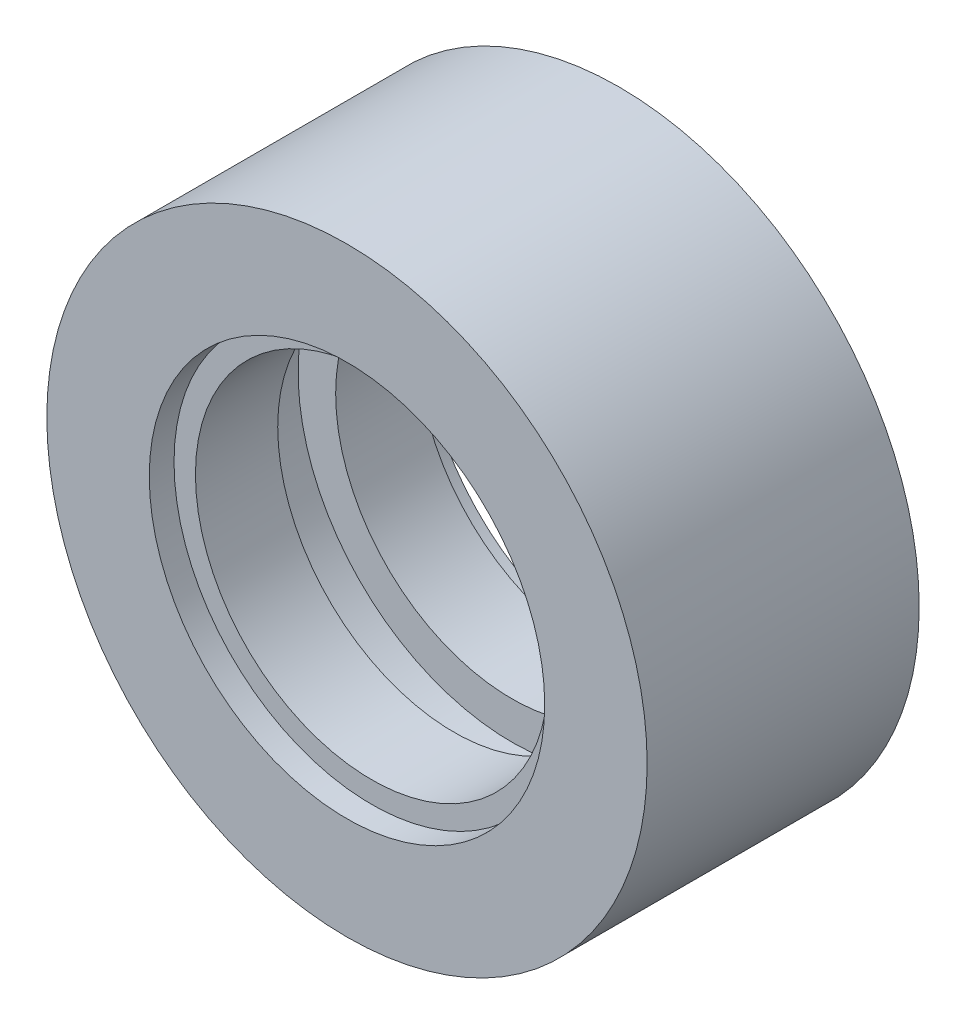
ISO-10303-21;
HEADER;
FILE_DESCRIPTION(('STEP AP214'),'2;1');
FILE_NAME('part.step','',(''),(''),'','','');
FILE_SCHEMA(('AUTOMOTIVE_DESIGN { 1 0 10303 214 1 1 1 1 }'));
ENDSEC;
DATA;
#1=APPLICATION_CONTEXT('core data for automotive mechanical design processes');
#2=APPLICATION_PROTOCOL_DEFINITION('international standard','automotive_design',2000,#1);
#3=PRODUCT_CONTEXT('',#1,'mechanical');
#4=PRODUCT('Part','Part','',(#3));
#5=PRODUCT_RELATED_PRODUCT_CATEGORY('part','',(#4));
#6=PRODUCT_DEFINITION_FORMATION('','',#4);
#7=PRODUCT_DEFINITION_CONTEXT('part definition',#1,'design');
#8=PRODUCT_DEFINITION('design','',#6,#7);
#9=PRODUCT_DEFINITION_SHAPE('','',#8);
#10=(LENGTH_UNIT() NAMED_UNIT(*) SI_UNIT(.MILLI.,.METRE.));
#11=(NAMED_UNIT(*) PLANE_ANGLE_UNIT() SI_UNIT($,.RADIAN.));
#12=(NAMED_UNIT(*) SI_UNIT($,.STERADIAN.) SOLID_ANGLE_UNIT());
#13=UNCERTAINTY_MEASURE_WITH_UNIT(LENGTH_MEASURE(1.E-05),#10,'distance_accuracy_value','');
#14=(GEOMETRIC_REPRESENTATION_CONTEXT(3) GLOBAL_UNCERTAINTY_ASSIGNED_CONTEXT((#13)) GLOBAL_UNIT_ASSIGNED_CONTEXT((#10,
#11,#12)) REPRESENTATION_CONTEXT('',''));
#15=CARTESIAN_POINT('',(0.,0.,0.));
#16=DIRECTION('',(0.,0.,1.));
#17=DIRECTION('',(1.,0.,0.));
#18=AXIS2_PLACEMENT_3D('',#15,#16,#17);
#19=CARTESIAN_POINT('',(0.,0.,-0.000999999999999265));
#20=DIRECTION('',(0.,0.,1.));
#21=DIRECTION('',(1.,0.,0.));
#22=AXIS2_PLACEMENT_3D('',#19,#20,#21);
#23=CYLINDRICAL_SURFACE('',#22,8.4);
#24=CARTESIAN_POINT('',(0.,0.,1.18));
#25=DIRECTION('',(0.,0.,-1.));
#26=DIRECTION('',(-1.,0.,0.));
#27=AXIS2_PLACEMENT_3D('',#24,#25,#26);
#28=CIRCLE('',#27,8.4);
#29=CARTESIAN_POINT('',(-8.4,0.,1.18));
#30=VERTEX_POINT('',#29);
#31=EDGE_CURVE('E54',#30,#30,#28,.F.);
#32=ORIENTED_EDGE('',*,*,#31,.F.);
#33=EDGE_LOOP('',(#32));
#34=FACE_BOUND('',#33,.T.);
#35=CARTESIAN_POINT('',(0.,0.,5.1));
#36=DIRECTION('',(0.,0.,1.));
#37=DIRECTION('',(1.,0.,0.));
#38=AXIS2_PLACEMENT_3D('',#35,#36,#37);
#39=CIRCLE('',#38,8.4);
#40=CARTESIAN_POINT('',(8.4,0.,5.1));
#41=VERTEX_POINT('',#40);
#42=EDGE_CURVE('E36',#41,#41,#39,.F.);
#43=ORIENTED_EDGE('',*,*,#42,.F.);
#44=EDGE_LOOP('',(#43));
#45=FACE_BOUND('',#44,.T.);
#46=ADVANCED_FACE('F32',(#34,#45),#23,.F.);
#47=CARTESIAN_POINT('',(0.,0.,7.86));
#48=DIRECTION('',(0.,0.,1.));
#49=DIRECTION('',(1.,0.,0.));
#50=AXIS2_PLACEMENT_3D('',#47,#48,#49);
#51=CIRCLE('',#50,8.4);
#52=CARTESIAN_POINT('',(8.4,0.,7.86));
#53=VERTEX_POINT('',#52);
#54=EDGE_CURVE('E57',#53,#53,#51,.F.);
#55=ORIENTED_EDGE('',*,*,#54,.T.);
#56=EDGE_LOOP('',(#55));
#57=FACE_BOUND('',#56,.T.);
#58=CARTESIAN_POINT('',(0.,0.,11.78));
#59=DIRECTION('',(0.,0.,1.));
#60=DIRECTION('',(1.,0.,0.));
#61=AXIS2_PLACEMENT_3D('',#58,#59,#60);
#62=CIRCLE('',#61,8.4);
#63=CARTESIAN_POINT('',(8.4,0.,11.78));
#64=VERTEX_POINT('',#63);
#65=EDGE_CURVE('E45',#64,#64,#62,.F.);
#66=ORIENTED_EDGE('',*,*,#65,.F.);
#67=EDGE_LOOP('',(#66));
#68=FACE_BOUND('',#67,.T.);
#69=ADVANCED_FACE('F93',(#57,#68),#23,.F.);
#70=CARTESIAN_POINT('',(0.,0.,12.96));
#71=DIRECTION('',(0.,0.,-1.));
#72=DIRECTION('',(-1.,0.,0.));
#73=AXIS2_PLACEMENT_3D('',#70,#71,#72);
#74=CYLINDRICAL_SURFACE('',#73,14.3);
#75=CARTESIAN_POINT('',(0.,0.,12.96));
#76=DIRECTION('',(0.,0.,1.));
#77=DIRECTION('',(1.,0.,0.));
#78=AXIS2_PLACEMENT_3D('',#75,#76,#77);
#79=CIRCLE('',#78,14.3);
#80=CARTESIAN_POINT('',(14.3,0.,12.96));
#81=VERTEX_POINT('',#80);
#82=EDGE_CURVE('E10',#81,#81,#79,.T.);
#83=ORIENTED_EDGE('',*,*,#82,.F.);
#84=EDGE_LOOP('',(#83));
#85=FACE_BOUND('',#84,.T.);
#86=CARTESIAN_POINT('',(0.,0.,0.));
#87=DIRECTION('',(0.,0.,1.));
#88=DIRECTION('',(1.,0.,0.));
#89=AXIS2_PLACEMENT_3D('',#86,#87,#88);
#90=CIRCLE('',#89,14.3);
#91=CARTESIAN_POINT('',(14.3,0.,0.));
#92=VERTEX_POINT('',#91);
#93=EDGE_CURVE('E40',#92,#92,#90,.T.);
#94=ORIENTED_EDGE('',*,*,#93,.T.);
#95=EDGE_LOOP('',(#94));
#96=FACE_BOUND('',#95,.T.);
#97=ADVANCED_FACE('F34',(#85,#96),#74,.T.);
#98=CARTESIAN_POINT('',(0.,0.,12.96));
#99=DIRECTION('',(0.,0.,1.));
#100=DIRECTION('',(1.,0.,0.));
#101=AXIS2_PLACEMENT_3D('',#98,#99,#100);
#102=PLANE('',#101);
#103=CARTESIAN_POINT('',(0.,0.,12.96));
#104=DIRECTION('',(0.,0.,1.));
#105=DIRECTION('',(1.,0.,0.));
#106=AXIS2_PLACEMENT_3D('',#103,#104,#105);
#107=CIRCLE('',#106,9.42);
#108=CARTESIAN_POINT('',(9.42,0.,12.96));
#109=VERTEX_POINT('',#108);
#110=EDGE_CURVE('E48',#109,#109,#107,.T.);
#111=ORIENTED_EDGE('',*,*,#110,.F.);
#112=EDGE_LOOP('',(#111));
#113=FACE_BOUND('',#112,.T.);
#114=ORIENTED_EDGE('',*,*,#82,.T.);
#115=EDGE_LOOP('',(#114));
#116=FACE_BOUND('',#115,.T.);
#117=ADVANCED_FACE('F83',(#113,#116),#102,.T.);
#118=CARTESIAN_POINT('',(0.,0.,0.));
#119=DIRECTION('',(0.,0.,1.));
#120=DIRECTION('',(1.,0.,0.));
#121=AXIS2_PLACEMENT_3D('',#118,#119,#120);
#122=PLANE('',#121);
#123=CARTESIAN_POINT('',(0.,0.,0.));
#124=DIRECTION('',(0.,0.,1.));
#125=DIRECTION('',(1.,0.,0.));
#126=AXIS2_PLACEMENT_3D('',#123,#124,#125);
#127=CIRCLE('',#126,9.42);
#128=CARTESIAN_POINT('',(9.42,0.,0.));
#129=VERTEX_POINT('',#128);
#130=EDGE_CURVE('E63',#129,#129,#127,.T.);
#131=ORIENTED_EDGE('',*,*,#130,.T.);
#132=EDGE_LOOP('',(#131));
#133=FACE_BOUND('',#132,.T.);
#134=ORIENTED_EDGE('',*,*,#93,.F.);
#135=EDGE_LOOP('',(#134));
#136=FACE_BOUND('',#135,.T.);
#137=ADVANCED_FACE('F85',(#133,#136),#122,.F.);
#138=CARTESIAN_POINT('',(0.,0.,11.78));
#139=DIRECTION('',(0.,0.,1.));
#140=DIRECTION('',(1.,0.,0.));
#141=AXIS2_PLACEMENT_3D('',#138,#139,#140);
#142=PLANE('',#141);
#143=CARTESIAN_POINT('',(0.,0.,11.78));
#144=DIRECTION('',(0.,0.,1.));
#145=DIRECTION('',(1.,0.,0.));
#146=AXIS2_PLACEMENT_3D('',#143,#144,#145);
#147=CIRCLE('',#146,9.42);
#148=CARTESIAN_POINT('',(9.42,0.,11.78));
#149=VERTEX_POINT('',#148);
#150=EDGE_CURVE('E53',#149,#149,#147,.T.);
#151=ORIENTED_EDGE('',*,*,#150,.T.);
#152=EDGE_LOOP('',(#151));
#153=FACE_BOUND('',#152,.T.);
#154=ORIENTED_EDGE('',*,*,#65,.T.);
#155=EDGE_LOOP('',(#154));
#156=FACE_BOUND('',#155,.T.);
#157=ADVANCED_FACE('F91',(#153,#156),#142,.T.);
#158=CARTESIAN_POINT('',(0.,0.,11.78));
#159=DIRECTION('',(0.,0.,1.));
#160=DIRECTION('',(1.,0.,0.));
#161=AXIS2_PLACEMENT_3D('',#158,#159,#160);
#162=CYLINDRICAL_SURFACE('',#161,9.42);
#163=ORIENTED_EDGE('',*,*,#150,.F.);
#164=EDGE_LOOP('',(#163));
#165=FACE_BOUND('',#164,.T.);
#166=ORIENTED_EDGE('',*,*,#110,.T.);
#167=EDGE_LOOP('',(#166));
#168=FACE_BOUND('',#167,.T.);
#169=ADVANCED_FACE('F81',(#165,#168),#162,.F.);
#170=CARTESIAN_POINT('',(0.,0.,1.18));
#171=DIRECTION('',(0.,0.,-1.));
#172=DIRECTION('',(1.,0.,0.));
#173=AXIS2_PLACEMENT_3D('',#170,#171,#172);
#174=PLANE('',#173);
#175=CARTESIAN_POINT('',(0.,0.,1.18));
#176=DIRECTION('',(0.,0.,1.));
#177=DIRECTION('',(1.,0.,0.));
#178=AXIS2_PLACEMENT_3D('',#175,#176,#177);
#179=CIRCLE('',#178,9.42);
#180=CARTESIAN_POINT('',(9.42,0.,1.18));
#181=VERTEX_POINT('',#180);
#182=EDGE_CURVE('E56',#181,#181,#179,.T.);
#183=ORIENTED_EDGE('',*,*,#182,.F.);
#184=EDGE_LOOP('',(#183));
#185=FACE_BOUND('',#184,.T.);
#186=ORIENTED_EDGE('',*,*,#31,.T.);
#187=EDGE_LOOP('',(#186));
#188=FACE_BOUND('',#187,.T.);
#189=ADVANCED_FACE('F106',(#185,#188),#174,.T.);
#190=CARTESIAN_POINT('',(0.,0.,1.18));
#191=DIRECTION('',(0.,0.,-1.));
#192=DIRECTION('',(-1.,0.,0.));
#193=AXIS2_PLACEMENT_3D('',#190,#191,#192);
#194=CYLINDRICAL_SURFACE('',#193,9.42);
#195=ORIENTED_EDGE('',*,*,#182,.T.);
#196=EDGE_LOOP('',(#195));
#197=FACE_BOUND('',#196,.T.);
#198=ORIENTED_EDGE('',*,*,#130,.F.);
#199=EDGE_LOOP('',(#198));
#200=FACE_BOUND('',#199,.T.);
#201=ADVANCED_FACE('F110',(#197,#200),#194,.F.);
#202=CARTESIAN_POINT('',(0.,0.,5.1));
#203=DIRECTION('',(0.,0.,1.));
#204=DIRECTION('',(1.,0.,0.));
#205=AXIS2_PLACEMENT_3D('',#202,#203,#204);
#206=PLANE('',#205);
#207=CARTESIAN_POINT('',(0.,0.,5.1));
#208=DIRECTION('',(0.,0.,1.));
#209=DIRECTION('',(1.,0.,0.));
#210=AXIS2_PLACEMENT_3D('',#207,#208,#209);
#211=CIRCLE('',#210,10.19);
#212=CARTESIAN_POINT('',(10.19,0.,5.1));
#213=VERTEX_POINT('',#212);
#214=EDGE_CURVE('E59',#213,#213,#211,.T.);
#215=ORIENTED_EDGE('',*,*,#214,.T.);
#216=EDGE_LOOP('',(#215));
#217=FACE_BOUND('',#216,.T.);
#218=ORIENTED_EDGE('',*,*,#42,.T.);
#219=EDGE_LOOP('',(#218));
#220=FACE_BOUND('',#219,.T.);
#221=ADVANCED_FACE('F113',(#217,#220),#206,.T.);
#222=CARTESIAN_POINT('',(0.,0.,7.86));
#223=DIRECTION('',(0.,0.,1.));
#224=DIRECTION('',(1.,0.,0.));
#225=AXIS2_PLACEMENT_3D('',#222,#223,#224);
#226=PLANE('',#225);
#227=CARTESIAN_POINT('',(0.,0.,7.86));
#228=DIRECTION('',(0.,0.,1.));
#229=DIRECTION('',(1.,0.,0.));
#230=AXIS2_PLACEMENT_3D('',#227,#228,#229);
#231=CIRCLE('',#230,10.19);
#232=CARTESIAN_POINT('',(10.19,0.,7.86));
#233=VERTEX_POINT('',#232);
#234=EDGE_CURVE('E65',#233,#233,#231,.T.);
#235=ORIENTED_EDGE('',*,*,#234,.F.);
#236=EDGE_LOOP('',(#235));
#237=FACE_BOUND('',#236,.T.);
#238=ORIENTED_EDGE('',*,*,#54,.F.);
#239=EDGE_LOOP('',(#238));
#240=FACE_BOUND('',#239,.T.);
#241=ADVANCED_FACE('F121',(#237,#240),#226,.F.);
#242=CARTESIAN_POINT('',(0.,0.,5.1));
#243=DIRECTION('',(0.,0.,1.));
#244=DIRECTION('',(1.,0.,0.));
#245=AXIS2_PLACEMENT_3D('',#242,#243,#244);
#246=CYLINDRICAL_SURFACE('',#245,10.19);
#247=ORIENTED_EDGE('',*,*,#214,.F.);
#248=EDGE_LOOP('',(#247));
#249=FACE_BOUND('',#248,.T.);
#250=ORIENTED_EDGE('',*,*,#234,.T.);
#251=EDGE_LOOP('',(#250));
#252=FACE_BOUND('',#251,.T.);
#253=ADVANCED_FACE('F118',(#249,#252),#246,.F.);
#254=CLOSED_SHELL('',(#46,#69,#97,#117,#137,#157,#169,#189,#201,#221,#241,#253));
#255=MANIFOLD_SOLID_BREP('B2',#254);
#256=ADVANCED_BREP_SHAPE_REPRESENTATION('',(#18,#255),#14);
#257=SHAPE_DEFINITION_REPRESENTATION(#9,#256);
ENDSEC;
END-ISO-10303-21;
